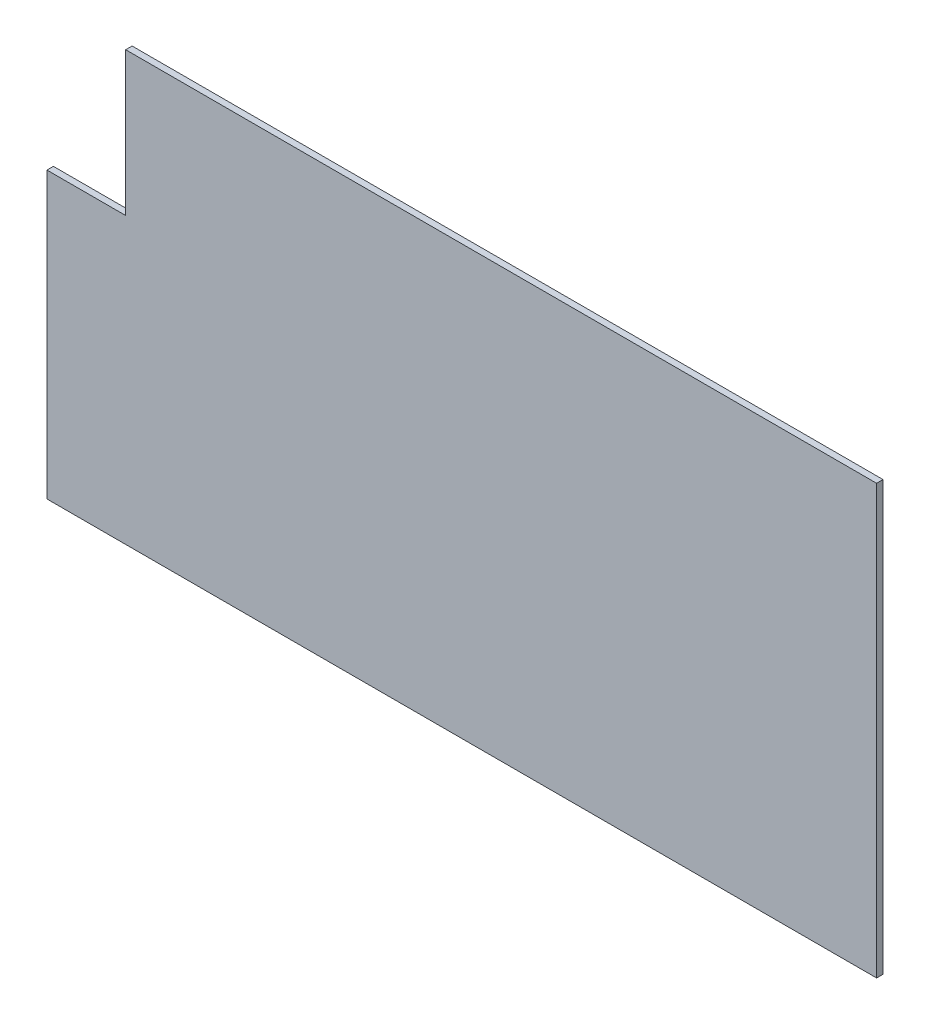
ISO-10303-21;
HEADER;
FILE_DESCRIPTION(('STEP AP214'),'2;1');
FILE_NAME('part.step','',(''),(''),'','','');
FILE_SCHEMA(('AUTOMOTIVE_DESIGN { 1 0 10303 214 1 1 1 1 }'));
ENDSEC;
DATA;
#1=APPLICATION_CONTEXT('core data for automotive mechanical design processes');
#2=APPLICATION_PROTOCOL_DEFINITION('international standard','automotive_design',2000,#1);
#3=PRODUCT_CONTEXT('',#1,'mechanical');
#4=PRODUCT('Part','Part','',(#3));
#5=PRODUCT_RELATED_PRODUCT_CATEGORY('part','',(#4));
#6=PRODUCT_DEFINITION_FORMATION('','',#4);
#7=PRODUCT_DEFINITION_CONTEXT('part definition',#1,'design');
#8=PRODUCT_DEFINITION('design','',#6,#7);
#9=PRODUCT_DEFINITION_SHAPE('','',#8);
#10=(LENGTH_UNIT() NAMED_UNIT(*) SI_UNIT(.MILLI.,.METRE.));
#11=(NAMED_UNIT(*) PLANE_ANGLE_UNIT() SI_UNIT($,.RADIAN.));
#12=(NAMED_UNIT(*) SI_UNIT($,.STERADIAN.) SOLID_ANGLE_UNIT());
#13=UNCERTAINTY_MEASURE_WITH_UNIT(LENGTH_MEASURE(1.E-05),#10,'distance_accuracy_value','');
#14=(GEOMETRIC_REPRESENTATION_CONTEXT(3) GLOBAL_UNCERTAINTY_ASSIGNED_CONTEXT((#13)) GLOBAL_UNIT_ASSIGNED_CONTEXT((#10,
#11,#12)) REPRESENTATION_CONTEXT('',''));
#15=CARTESIAN_POINT('',(0.,0.,0.));
#16=DIRECTION('',(0.,0.,1.));
#17=DIRECTION('',(1.,0.,0.));
#18=AXIS2_PLACEMENT_3D('',#15,#16,#17);
#19=CARTESIAN_POINT('',(289.5,-149.5,2.2479));
#20=DIRECTION('',(-1.,0.,0.));
#21=DIRECTION('',(0.,0.,1.));
#22=AXIS2_PLACEMENT_3D('',#19,#20,#21);
#23=PLANE('',#22);
#24=DIRECTION('',(0.,1.,0.));
#25=VECTOR('',#24,1.);
#26=CARTESIAN_POINT('',(289.5,-149.5,-2.2479));
#27=LINE('',#26,#25);
#28=CARTESIAN_POINT('',(289.5,-149.5,-2.2479));
#29=VERTEX_POINT('',#28);
#30=CARTESIAN_POINT('',(289.5,149.5,-2.2479));
#31=VERTEX_POINT('',#30);
#32=EDGE_CURVE('E119',#29,#31,#27,.T.);
#33=ORIENTED_EDGE('',*,*,#32,.T.);
#34=DIRECTION('',(0.,0.,-1.));
#35=VECTOR('',#34,1.);
#36=CARTESIAN_POINT('',(289.5,149.5,2.2479));
#37=LINE('',#36,#35);
#38=CARTESIAN_POINT('',(289.5,149.5,2.2479));
#39=VERTEX_POINT('',#38);
#40=EDGE_CURVE('E11',#39,#31,#37,.T.);
#41=ORIENTED_EDGE('',*,*,#40,.F.);
#42=DIRECTION('',(0.,1.,0.));
#43=VECTOR('',#42,1.);
#44=CARTESIAN_POINT('',(289.5,-149.5,2.2479));
#45=LINE('',#44,#43);
#46=CARTESIAN_POINT('',(289.5,-149.5,2.2479));
#47=VERTEX_POINT('',#46);
#48=EDGE_CURVE('E120',#47,#39,#45,.T.);
#49=ORIENTED_EDGE('',*,*,#48,.F.);
#50=DIRECTION('',(0.,0.,-1.));
#51=VECTOR('',#50,1.);
#52=CARTESIAN_POINT('',(289.5,-149.5,2.2479));
#53=LINE('',#52,#51);
#54=EDGE_CURVE('E126',#47,#29,#53,.T.);
#55=ORIENTED_EDGE('',*,*,#54,.T.);
#56=EDGE_LOOP('',(#33,#41,#49,#55));
#57=FACE_BOUND('',#56,.T.);
#58=ADVANCED_FACE('F33',(#57),#23,.F.);
#59=CARTESIAN_POINT('',(-289.5,149.5,2.2479));
#60=DIRECTION('',(0.,-1.,0.));
#61=DIRECTION('',(0.,0.,-1.));
#62=AXIS2_PLACEMENT_3D('',#59,#60,#61);
#63=PLANE('',#62);
#64=DIRECTION('',(-1.,0.,0.));
#65=VECTOR('',#64,1.);
#66=CARTESIAN_POINT('',(-289.5,149.5,-2.2479));
#67=LINE('',#66,#65);
#68=CARTESIAN_POINT('',(-234.550006437455,149.5,-2.2479));
#69=VERTEX_POINT('',#68);
#70=EDGE_CURVE('E129',#31,#69,#67,.T.);
#71=ORIENTED_EDGE('',*,*,#70,.T.);
#72=DIRECTION('',(0.,0.,-1.));
#73=VECTOR('',#72,1.);
#74=CARTESIAN_POINT('',(-234.550006437455,149.5,116.526252248026));
#75=LINE('',#74,#73);
#76=CARTESIAN_POINT('',(-234.550006437455,149.5,2.2479));
#77=VERTEX_POINT('',#76);
#78=EDGE_CURVE('E47',#77,#69,#75,.T.);
#79=ORIENTED_EDGE('',*,*,#78,.F.);
#80=DIRECTION('',(-1.,0.,0.));
#81=VECTOR('',#80,1.);
#82=CARTESIAN_POINT('',(-289.5,149.5,2.2479));
#83=LINE('',#82,#81);
#84=EDGE_CURVE('E78',#39,#77,#83,.T.);
#85=ORIENTED_EDGE('',*,*,#84,.F.);
#86=ORIENTED_EDGE('',*,*,#40,.T.);
#87=EDGE_LOOP('',(#71,#79,#85,#86));
#88=FACE_BOUND('',#87,.T.);
#89=ADVANCED_FACE('F142',(#88),#63,.F.);
#90=CARTESIAN_POINT('',(-289.5,-149.5,2.2479));
#91=DIRECTION('',(1.,0.,0.));
#92=DIRECTION('',(0.,0.,-1.));
#93=AXIS2_PLACEMENT_3D('',#90,#91,#92);
#94=PLANE('',#93);
#95=DIRECTION('',(0.,-1.,0.));
#96=VECTOR('',#95,1.);
#97=CARTESIAN_POINT('',(-289.5,-149.5,2.2479));
#98=LINE('',#97,#96);
#99=CARTESIAN_POINT('',(-289.5,49.2999999999998,2.2479));
#100=VERTEX_POINT('',#99);
#101=CARTESIAN_POINT('',(-289.5,-149.5,2.2479));
#102=VERTEX_POINT('',#101);
#103=EDGE_CURVE('E123',#100,#102,#98,.T.);
#104=ORIENTED_EDGE('',*,*,#103,.F.);
#105=DIRECTION('',(0.,0.,-1.));
#106=VECTOR('',#105,1.);
#107=CARTESIAN_POINT('',(-289.5,49.2999999999998,116.526252248026));
#108=LINE('',#107,#106);
#109=CARTESIAN_POINT('',(-289.5,49.2999999999998,-2.2479));
#110=VERTEX_POINT('',#109);
#111=EDGE_CURVE('E102',#100,#110,#108,.T.);
#112=ORIENTED_EDGE('',*,*,#111,.T.);
#113=DIRECTION('',(0.,-1.,0.));
#114=VECTOR('',#113,1.);
#115=CARTESIAN_POINT('',(-289.5,-149.5,-2.2479));
#116=LINE('',#115,#114);
#117=CARTESIAN_POINT('',(-289.5,-149.5,-2.2479));
#118=VERTEX_POINT('',#117);
#119=EDGE_CURVE('E111',#110,#118,#116,.T.);
#120=ORIENTED_EDGE('',*,*,#119,.T.);
#121=DIRECTION('',(0.,0.,-1.));
#122=VECTOR('',#121,1.);
#123=CARTESIAN_POINT('',(-289.5,-149.5,2.2479));
#124=LINE('',#123,#122);
#125=EDGE_CURVE('E40',#102,#118,#124,.T.);
#126=ORIENTED_EDGE('',*,*,#125,.F.);
#127=EDGE_LOOP('',(#104,#112,#120,#126));
#128=FACE_BOUND('',#127,.T.);
#129=ADVANCED_FACE('F144',(#128),#94,.F.);
#130=CARTESIAN_POINT('',(-289.5,-149.5,2.2479));
#131=DIRECTION('',(0.,1.,0.));
#132=DIRECTION('',(0.,0.,1.));
#133=AXIS2_PLACEMENT_3D('',#130,#131,#132);
#134=PLANE('',#133);
#135=DIRECTION('',(1.,0.,0.));
#136=VECTOR('',#135,1.);
#137=CARTESIAN_POINT('',(-289.5,-149.5,-2.2479));
#138=LINE('',#137,#136);
#139=EDGE_CURVE('E73',#118,#29,#138,.T.);
#140=ORIENTED_EDGE('',*,*,#139,.T.);
#141=ORIENTED_EDGE('',*,*,#54,.F.);
#142=DIRECTION('',(1.,0.,0.));
#143=VECTOR('',#142,1.);
#144=CARTESIAN_POINT('',(-289.5,-149.5,2.2479));
#145=LINE('',#144,#143);
#146=EDGE_CURVE('E56',#102,#47,#145,.T.);
#147=ORIENTED_EDGE('',*,*,#146,.F.);
#148=ORIENTED_EDGE('',*,*,#125,.T.);
#149=EDGE_LOOP('',(#140,#141,#147,#148));
#150=FACE_BOUND('',#149,.T.);
#151=ADVANCED_FACE('F134',(#150),#134,.F.);
#152=CARTESIAN_POINT('',(0.,0.,2.2479));
#153=DIRECTION('',(0.,0.,-1.));
#154=DIRECTION('',(-1.,0.,0.));
#155=AXIS2_PLACEMENT_3D('',#152,#153,#154);
#156=PLANE('',#155);
#157=DIRECTION('',(0.,1.,0.));
#158=VECTOR('',#157,1.);
#159=CARTESIAN_POINT('',(-234.550006437455,49.2999999999998,2.2479));
#160=LINE('',#159,#158);
#161=CARTESIAN_POINT('',(-234.550006437455,49.2999999999998,2.2479));
#162=VERTEX_POINT('',#161);
#163=EDGE_CURVE('E117',#162,#77,#160,.T.);
#164=ORIENTED_EDGE('',*,*,#163,.F.);
#165=DIRECTION('',(1.,0.,0.));
#166=VECTOR('',#165,1.);
#167=CARTESIAN_POINT('',(-234.550006437455,49.2999999999998,2.2479));
#168=LINE('',#167,#166);
#169=EDGE_CURVE('E100',#100,#162,#168,.T.);
#170=ORIENTED_EDGE('',*,*,#169,.F.);
#171=ORIENTED_EDGE('',*,*,#103,.T.);
#172=ORIENTED_EDGE('',*,*,#146,.T.);
#173=ORIENTED_EDGE('',*,*,#48,.T.);
#174=ORIENTED_EDGE('',*,*,#84,.T.);
#175=EDGE_LOOP('',(#164,#170,#171,#172,#173,#174));
#176=FACE_BOUND('',#175,.T.);
#177=ADVANCED_FACE('F141',(#176),#156,.F.);
#178=CARTESIAN_POINT('',(0.,0.,-2.2479));
#179=DIRECTION('',(0.,0.,-1.));
#180=DIRECTION('',(-1.,0.,0.));
#181=AXIS2_PLACEMENT_3D('',#178,#179,#180);
#182=PLANE('',#181);
#183=DIRECTION('',(-1.,0.,0.));
#184=VECTOR('',#183,1.);
#185=CARTESIAN_POINT('',(-234.550006437455,49.2999999999998,-2.2479));
#186=LINE('',#185,#184);
#187=CARTESIAN_POINT('',(-234.550006437455,49.2999999999998,-2.2479));
#188=VERTEX_POINT('',#187);
#189=EDGE_CURVE('E97',#188,#110,#186,.T.);
#190=ORIENTED_EDGE('',*,*,#189,.F.);
#191=DIRECTION('',(0.,-1.,0.));
#192=VECTOR('',#191,1.);
#193=CARTESIAN_POINT('',(-234.550006437455,49.2999999999998,-2.2479));
#194=LINE('',#193,#192);
#195=EDGE_CURVE('E104',#69,#188,#194,.T.);
#196=ORIENTED_EDGE('',*,*,#195,.F.);
#197=ORIENTED_EDGE('',*,*,#70,.F.);
#198=ORIENTED_EDGE('',*,*,#32,.F.);
#199=ORIENTED_EDGE('',*,*,#139,.F.);
#200=ORIENTED_EDGE('',*,*,#119,.F.);
#201=EDGE_LOOP('',(#190,#196,#197,#198,#199,#200));
#202=FACE_BOUND('',#201,.T.);
#203=ADVANCED_FACE('F110',(#202),#182,.T.);
#204=CARTESIAN_POINT('',(-234.550006437455,49.2999999999998,116.526252248026));
#205=DIRECTION('',(0.,-1.,0.));
#206=DIRECTION('',(0.,0.,-1.));
#207=AXIS2_PLACEMENT_3D('',#204,#205,#206);
#208=PLANE('',#207);
#209=ORIENTED_EDGE('',*,*,#169,.T.);
#210=DIRECTION('',(0.,0.,-1.));
#211=VECTOR('',#210,1.);
#212=CARTESIAN_POINT('',(-234.550006437455,49.2999999999998,116.526252248026));
#213=LINE('',#212,#211);
#214=EDGE_CURVE('E94',#162,#188,#213,.T.);
#215=ORIENTED_EDGE('',*,*,#214,.T.);
#216=ORIENTED_EDGE('',*,*,#189,.T.);
#217=ORIENTED_EDGE('',*,*,#111,.F.);
#218=EDGE_LOOP('',(#209,#215,#216,#217));
#219=FACE_BOUND('',#218,.T.);
#220=ADVANCED_FACE('F95',(#219),#208,.F.);
#221=CARTESIAN_POINT('',(-234.550006437455,49.2999999999998,116.526252248026));
#222=DIRECTION('',(1.,0.,0.));
#223=DIRECTION('',(0.,0.,-1.));
#224=AXIS2_PLACEMENT_3D('',#221,#222,#223);
#225=PLANE('',#224);
#226=ORIENTED_EDGE('',*,*,#163,.T.);
#227=ORIENTED_EDGE('',*,*,#78,.T.);
#228=ORIENTED_EDGE('',*,*,#195,.T.);
#229=ORIENTED_EDGE('',*,*,#214,.F.);
#230=EDGE_LOOP('',(#226,#227,#228,#229));
#231=FACE_BOUND('',#230,.T.);
#232=ADVANCED_FACE('F105',(#231),#225,.F.);
#233=CLOSED_SHELL('',(#58,#89,#129,#151,#177,#203,#220,#232));
#234=MANIFOLD_SOLID_BREP('B2',#233);
#235=ADVANCED_BREP_SHAPE_REPRESENTATION('',(#18,#234),#14);
#236=SHAPE_DEFINITION_REPRESENTATION(#9,#235);
ENDSEC;
END-ISO-10303-21;
